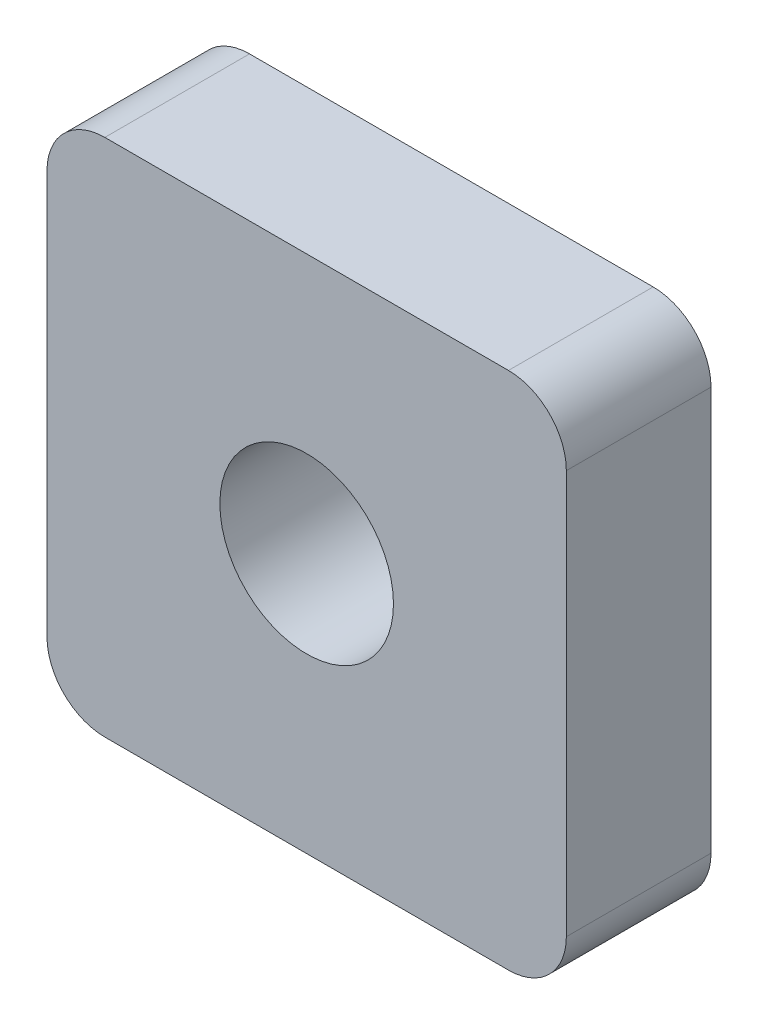
ISO-10303-21;
HEADER;
FILE_DESCRIPTION(('STEP AP214'),'2;1');
FILE_NAME('part.step','',(''),(''),'','','');
FILE_SCHEMA(('AUTOMOTIVE_DESIGN { 1 0 10303 214 1 1 1 1 }'));
ENDSEC;
DATA;
#1=APPLICATION_CONTEXT('core data for automotive mechanical design processes');
#2=APPLICATION_PROTOCOL_DEFINITION('international standard','automotive_design',2000,#1);
#3=PRODUCT_CONTEXT('',#1,'mechanical');
#4=PRODUCT('Part','Part','',(#3));
#5=PRODUCT_RELATED_PRODUCT_CATEGORY('part','',(#4));
#6=PRODUCT_DEFINITION_FORMATION('','',#4);
#7=PRODUCT_DEFINITION_CONTEXT('part definition',#1,'design');
#8=PRODUCT_DEFINITION('design','',#6,#7);
#9=PRODUCT_DEFINITION_SHAPE('','',#8);
#10=(LENGTH_UNIT() NAMED_UNIT(*) SI_UNIT(.MILLI.,.METRE.));
#11=(NAMED_UNIT(*) PLANE_ANGLE_UNIT() SI_UNIT($,.RADIAN.));
#12=(NAMED_UNIT(*) SI_UNIT($,.STERADIAN.) SOLID_ANGLE_UNIT());
#13=UNCERTAINTY_MEASURE_WITH_UNIT(LENGTH_MEASURE(1.E-05),#10,'distance_accuracy_value','');
#14=(GEOMETRIC_REPRESENTATION_CONTEXT(3) GLOBAL_UNCERTAINTY_ASSIGNED_CONTEXT((#13)) GLOBAL_UNIT_ASSIGNED_CONTEXT((#10,
#11,#12)) REPRESENTATION_CONTEXT('',''));
#15=CARTESIAN_POINT('',(0.,0.,0.));
#16=DIRECTION('',(0.,0.,1.));
#17=DIRECTION('',(1.,0.,0.));
#18=AXIS2_PLACEMENT_3D('',#15,#16,#17);
#19=CARTESIAN_POINT('',(0.,0.,5.));
#20=DIRECTION('',(0.,0.,-1.));
#21=DIRECTION('',(-1.,0.,0.));
#22=AXIS2_PLACEMENT_3D('',#19,#20,#21);
#23=PLANE('',#22);
#24=DIRECTION('',(1.,0.,0.));
#25=VECTOR('',#24,1.);
#26=CARTESIAN_POINT('',(-8.975,-8.975,5.));
#27=LINE('',#26,#25);
#28=CARTESIAN_POINT('',(-6.975,-8.975,5.));
#29=VERTEX_POINT('',#28);
#30=CARTESIAN_POINT('',(6.975,-8.975,5.));
#31=VERTEX_POINT('',#30);
#32=EDGE_CURVE('E140',#29,#31,#27,.T.);
#33=ORIENTED_EDGE('',*,*,#32,.T.);
#34=CARTESIAN_POINT('',(6.975,-6.975,5.));
#35=DIRECTION('',(0.,0.,-1.));
#36=DIRECTION('',(-1.,0.,0.));
#37=AXIS2_PLACEMENT_3D('',#34,#35,#36);
#38=CIRCLE('',#37,2.);
#39=CARTESIAN_POINT('',(8.975,-6.975,5.));
#40=VERTEX_POINT('',#39);
#41=EDGE_CURVE('E159',#31,#40,#38,.F.);
#42=ORIENTED_EDGE('',*,*,#41,.T.);
#43=DIRECTION('',(0.,1.,0.));
#44=VECTOR('',#43,1.);
#45=CARTESIAN_POINT('',(8.975,-8.975,5.));
#46=LINE('',#45,#44);
#47=CARTESIAN_POINT('',(8.975,6.975,5.));
#48=VERTEX_POINT('',#47);
#49=EDGE_CURVE('E123',#40,#48,#46,.T.);
#50=ORIENTED_EDGE('',*,*,#49,.T.);
#51=CARTESIAN_POINT('',(6.975,6.975,5.));
#52=DIRECTION('',(0.,0.,-1.));
#53=DIRECTION('',(-1.,0.,0.));
#54=AXIS2_PLACEMENT_3D('',#51,#52,#53);
#55=CIRCLE('',#54,2.);
#56=CARTESIAN_POINT('',(6.975,8.975,5.));
#57=VERTEX_POINT('',#56);
#58=EDGE_CURVE('E154',#48,#57,#55,.F.);
#59=ORIENTED_EDGE('',*,*,#58,.T.);
#60=DIRECTION('',(-1.,0.,0.));
#61=VECTOR('',#60,1.);
#62=CARTESIAN_POINT('',(-8.975,8.975,5.));
#63=LINE('',#62,#61);
#64=CARTESIAN_POINT('',(-6.975,8.975,5.));
#65=VERTEX_POINT('',#64);
#66=EDGE_CURVE('E170',#57,#65,#63,.T.);
#67=ORIENTED_EDGE('',*,*,#66,.T.);
#68=CARTESIAN_POINT('',(-6.975,6.975,5.));
#69=DIRECTION('',(0.,0.,-1.));
#70=DIRECTION('',(-1.,0.,0.));
#71=AXIS2_PLACEMENT_3D('',#68,#69,#70);
#72=CIRCLE('',#71,2.);
#73=CARTESIAN_POINT('',(-8.975,6.975,5.));
#74=VERTEX_POINT('',#73);
#75=EDGE_CURVE('E59',#65,#74,#72,.F.);
#76=ORIENTED_EDGE('',*,*,#75,.T.);
#77=DIRECTION('',(0.,-1.,0.));
#78=VECTOR('',#77,1.);
#79=CARTESIAN_POINT('',(-8.975,-8.975,5.));
#80=LINE('',#79,#78);
#81=CARTESIAN_POINT('',(-8.975,-6.975,5.));
#82=VERTEX_POINT('',#81);
#83=EDGE_CURVE('E178',#74,#82,#80,.T.);
#84=ORIENTED_EDGE('',*,*,#83,.T.);
#85=CARTESIAN_POINT('',(-6.975,-6.975,5.));
#86=DIRECTION('',(0.,0.,-1.));
#87=DIRECTION('',(-1.,0.,0.));
#88=AXIS2_PLACEMENT_3D('',#85,#86,#87);
#89=CIRCLE('',#88,2.);
#90=EDGE_CURVE('E157',#82,#29,#89,.F.);
#91=ORIENTED_EDGE('',*,*,#90,.T.);
#92=EDGE_LOOP('',(#33,#42,#50,#59,#67,#76,#84,#91));
#93=FACE_BOUND('',#92,.T.);
#94=CARTESIAN_POINT('',(0.,0.,5.));
#95=DIRECTION('',(0.,0.,1.));
#96=DIRECTION('',(1.,0.,0.));
#97=AXIS2_PLACEMENT_3D('',#94,#95,#96);
#98=CIRCLE('',#97,3.);
#99=CARTESIAN_POINT('',(3.,0.,5.));
#100=VERTEX_POINT('',#99);
#101=EDGE_CURVE('E131',#100,#100,#98,.T.);
#102=ORIENTED_EDGE('',*,*,#101,.F.);
#103=EDGE_LOOP('',(#102));
#104=FACE_BOUND('',#103,.T.);
#105=ADVANCED_FACE('F37',(#93,#104),#23,.F.);
#106=CARTESIAN_POINT('',(0.,0.,0.));
#107=DIRECTION('',(0.,0.,-1.));
#108=DIRECTION('',(-1.,0.,0.));
#109=AXIS2_PLACEMENT_3D('',#106,#107,#108);
#110=PLANE('',#109);
#111=DIRECTION('',(0.,1.,0.));
#112=VECTOR('',#111,1.);
#113=CARTESIAN_POINT('',(8.975,-8.975,0.));
#114=LINE('',#113,#112);
#115=CARTESIAN_POINT('',(8.975,-6.975,0.));
#116=VERTEX_POINT('',#115);
#117=CARTESIAN_POINT('',(8.975,6.975,0.));
#118=VERTEX_POINT('',#117);
#119=EDGE_CURVE('E120',#116,#118,#114,.T.);
#120=ORIENTED_EDGE('',*,*,#119,.F.);
#121=CARTESIAN_POINT('',(6.975,-6.975,0.));
#122=DIRECTION('',(0.,0.,-1.));
#123=DIRECTION('',(-1.,0.,0.));
#124=AXIS2_PLACEMENT_3D('',#121,#122,#123);
#125=CIRCLE('',#124,2.);
#126=CARTESIAN_POINT('',(6.975,-8.975,0.));
#127=VERTEX_POINT('',#126);
#128=EDGE_CURVE('E103',#116,#127,#125,.T.);
#129=ORIENTED_EDGE('',*,*,#128,.T.);
#130=DIRECTION('',(1.,0.,0.));
#131=VECTOR('',#130,1.);
#132=CARTESIAN_POINT('',(-8.975,-8.975,0.));
#133=LINE('',#132,#131);
#134=CARTESIAN_POINT('',(-6.975,-8.975,0.));
#135=VERTEX_POINT('',#134);
#136=EDGE_CURVE('E144',#135,#127,#133,.T.);
#137=ORIENTED_EDGE('',*,*,#136,.F.);
#138=CARTESIAN_POINT('',(-6.975,-6.975,0.));
#139=DIRECTION('',(0.,0.,-1.));
#140=DIRECTION('',(-1.,0.,0.));
#141=AXIS2_PLACEMENT_3D('',#138,#139,#140);
#142=CIRCLE('',#141,2.);
#143=CARTESIAN_POINT('',(-8.975,-6.975,0.));
#144=VERTEX_POINT('',#143);
#145=EDGE_CURVE('E114',#135,#144,#142,.T.);
#146=ORIENTED_EDGE('',*,*,#145,.T.);
#147=DIRECTION('',(0.,-1.,0.));
#148=VECTOR('',#147,1.);
#149=CARTESIAN_POINT('',(-8.975,-8.975,0.));
#150=LINE('',#149,#148);
#151=CARTESIAN_POINT('',(-8.975,6.975,0.));
#152=VERTEX_POINT('',#151);
#153=EDGE_CURVE('E134',#152,#144,#150,.T.);
#154=ORIENTED_EDGE('',*,*,#153,.F.);
#155=CARTESIAN_POINT('',(-6.975,6.975,0.));
#156=DIRECTION('',(0.,0.,-1.));
#157=DIRECTION('',(-1.,0.,0.));
#158=AXIS2_PLACEMENT_3D('',#155,#156,#157);
#159=CIRCLE('',#158,2.);
#160=CARTESIAN_POINT('',(-6.975,8.975,0.));
#161=VERTEX_POINT('',#160);
#162=EDGE_CURVE('E148',#152,#161,#159,.T.);
#163=ORIENTED_EDGE('',*,*,#162,.T.);
#164=DIRECTION('',(-1.,0.,0.));
#165=VECTOR('',#164,1.);
#166=CARTESIAN_POINT('',(-8.975,8.975,0.));
#167=LINE('',#166,#165);
#168=CARTESIAN_POINT('',(6.975,8.975,0.));
#169=VERTEX_POINT('',#168);
#170=EDGE_CURVE('E130',#169,#161,#167,.T.);
#171=ORIENTED_EDGE('',*,*,#170,.F.);
#172=CARTESIAN_POINT('',(6.975,6.975,0.));
#173=DIRECTION('',(0.,0.,-1.));
#174=DIRECTION('',(-1.,0.,0.));
#175=AXIS2_PLACEMENT_3D('',#172,#173,#174);
#176=CIRCLE('',#175,2.);
#177=EDGE_CURVE('E124',#169,#118,#176,.T.);
#178=ORIENTED_EDGE('',*,*,#177,.T.);
#179=EDGE_LOOP('',(#120,#129,#137,#146,#154,#163,#171,#178));
#180=FACE_BOUND('',#179,.T.);
#181=CARTESIAN_POINT('',(0.,0.,0.));
#182=DIRECTION('',(0.,0.,1.));
#183=DIRECTION('',(1.,0.,0.));
#184=AXIS2_PLACEMENT_3D('',#181,#182,#183);
#185=CIRCLE('',#184,3.);
#186=CARTESIAN_POINT('',(3.,0.,0.));
#187=VERTEX_POINT('',#186);
#188=EDGE_CURVE('E137',#187,#187,#185,.T.);
#189=ORIENTED_EDGE('',*,*,#188,.T.);
#190=EDGE_LOOP('',(#189));
#191=FACE_BOUND('',#190,.T.);
#192=ADVANCED_FACE('F127',(#180,#191),#110,.T.);
#193=CARTESIAN_POINT('',(8.975,-8.975,5.));
#194=DIRECTION('',(-1.,0.,0.));
#195=DIRECTION('',(0.,0.,1.));
#196=AXIS2_PLACEMENT_3D('',#193,#194,#195);
#197=PLANE('',#196);
#198=ORIENTED_EDGE('',*,*,#49,.F.);
#199=DIRECTION('',(0.,0.,-1.));
#200=VECTOR('',#199,1.);
#201=CARTESIAN_POINT('',(8.975,-6.975,5.));
#202=LINE('',#201,#200);
#203=EDGE_CURVE('E107',#40,#116,#202,.T.);
#204=ORIENTED_EDGE('',*,*,#203,.T.);
#205=ORIENTED_EDGE('',*,*,#119,.T.);
#206=DIRECTION('',(0.,0.,-1.));
#207=VECTOR('',#206,1.);
#208=CARTESIAN_POINT('',(8.975,6.975,5.));
#209=LINE('',#208,#207);
#210=EDGE_CURVE('E125',#118,#48,#209,.F.);
#211=ORIENTED_EDGE('',*,*,#210,.T.);
#212=EDGE_LOOP('',(#198,#204,#205,#211));
#213=FACE_BOUND('',#212,.T.);
#214=ADVANCED_FACE('F119',(#213),#197,.F.);
#215=CARTESIAN_POINT('',(-8.975,8.975,5.));
#216=DIRECTION('',(0.,-1.,0.));
#217=DIRECTION('',(0.,0.,-1.));
#218=AXIS2_PLACEMENT_3D('',#215,#216,#217);
#219=PLANE('',#218);
#220=ORIENTED_EDGE('',*,*,#170,.T.);
#221=DIRECTION('',(0.,0.,-1.));
#222=VECTOR('',#221,1.);
#223=CARTESIAN_POINT('',(-6.975,8.975,5.));
#224=LINE('',#223,#222);
#225=EDGE_CURVE('E11',#161,#65,#224,.F.);
#226=ORIENTED_EDGE('',*,*,#225,.T.);
#227=ORIENTED_EDGE('',*,*,#66,.F.);
#228=DIRECTION('',(0.,0.,-1.));
#229=VECTOR('',#228,1.);
#230=CARTESIAN_POINT('',(6.975,8.975,5.));
#231=LINE('',#230,#229);
#232=EDGE_CURVE('E45',#57,#169,#231,.T.);
#233=ORIENTED_EDGE('',*,*,#232,.T.);
#234=EDGE_LOOP('',(#220,#226,#227,#233));
#235=FACE_BOUND('',#234,.T.);
#236=ADVANCED_FACE('F168',(#235),#219,.F.);
#237=CARTESIAN_POINT('',(-8.975,-8.975,5.));
#238=DIRECTION('',(1.,0.,0.));
#239=DIRECTION('',(0.,0.,-1.));
#240=AXIS2_PLACEMENT_3D('',#237,#238,#239);
#241=PLANE('',#240);
#242=ORIENTED_EDGE('',*,*,#153,.T.);
#243=DIRECTION('',(0.,0.,-1.));
#244=VECTOR('',#243,1.);
#245=CARTESIAN_POINT('',(-8.975,-6.975,5.));
#246=LINE('',#245,#244);
#247=EDGE_CURVE('E52',#144,#82,#246,.F.);
#248=ORIENTED_EDGE('',*,*,#247,.T.);
#249=ORIENTED_EDGE('',*,*,#83,.F.);
#250=DIRECTION('',(0.,0.,-1.));
#251=VECTOR('',#250,1.);
#252=CARTESIAN_POINT('',(-8.975,6.975,5.));
#253=LINE('',#252,#251);
#254=EDGE_CURVE('E161',#74,#152,#253,.T.);
#255=ORIENTED_EDGE('',*,*,#254,.T.);
#256=EDGE_LOOP('',(#242,#248,#249,#255));
#257=FACE_BOUND('',#256,.T.);
#258=ADVANCED_FACE('F177',(#257),#241,.F.);
#259=CARTESIAN_POINT('',(-8.975,-8.975,5.));
#260=DIRECTION('',(0.,1.,0.));
#261=DIRECTION('',(0.,0.,1.));
#262=AXIS2_PLACEMENT_3D('',#259,#260,#261);
#263=PLANE('',#262);
#264=ORIENTED_EDGE('',*,*,#136,.T.);
#265=DIRECTION('',(0.,0.,-1.));
#266=VECTOR('',#265,1.);
#267=CARTESIAN_POINT('',(6.975,-8.975,5.));
#268=LINE('',#267,#266);
#269=EDGE_CURVE('E108',#127,#31,#268,.F.);
#270=ORIENTED_EDGE('',*,*,#269,.T.);
#271=ORIENTED_EDGE('',*,*,#32,.F.);
#272=DIRECTION('',(0.,0.,-1.));
#273=VECTOR('',#272,1.);
#274=CARTESIAN_POINT('',(-6.975,-8.975,5.));
#275=LINE('',#274,#273);
#276=EDGE_CURVE('E113',#29,#135,#275,.T.);
#277=ORIENTED_EDGE('',*,*,#276,.T.);
#278=EDGE_LOOP('',(#264,#270,#271,#277));
#279=FACE_BOUND('',#278,.T.);
#280=ADVANCED_FACE('F189',(#279),#263,.F.);
#281=CARTESIAN_POINT('',(0.,0.,5.));
#282=DIRECTION('',(0.,0.,-1.));
#283=DIRECTION('',(-1.,0.,0.));
#284=AXIS2_PLACEMENT_3D('',#281,#282,#283);
#285=CYLINDRICAL_SURFACE('',#284,3.);
#286=ORIENTED_EDGE('',*,*,#101,.T.);
#287=EDGE_LOOP('',(#286));
#288=FACE_BOUND('',#287,.T.);
#289=ORIENTED_EDGE('',*,*,#188,.F.);
#290=EDGE_LOOP('',(#289));
#291=FACE_BOUND('',#290,.T.);
#292=ADVANCED_FACE('F187',(#288,#291),#285,.F.);
#293=CARTESIAN_POINT('',(6.975,-6.975,5.));
#294=DIRECTION('',(0.,0.,-1.));
#295=DIRECTION('',(-1.,0.,0.));
#296=AXIS2_PLACEMENT_3D('',#293,#294,#295);
#297=CYLINDRICAL_SURFACE('',#296,2.);
#298=ORIENTED_EDGE('',*,*,#41,.F.);
#299=ORIENTED_EDGE('',*,*,#269,.F.);
#300=ORIENTED_EDGE('',*,*,#128,.F.);
#301=ORIENTED_EDGE('',*,*,#203,.F.);
#302=EDGE_LOOP('',(#298,#299,#300,#301));
#303=FACE_BOUND('',#302,.T.);
#304=ADVANCED_FACE('F106',(#303),#297,.T.);
#305=CARTESIAN_POINT('',(-6.975,-6.975,5.));
#306=DIRECTION('',(0.,0.,-1.));
#307=DIRECTION('',(-1.,0.,0.));
#308=AXIS2_PLACEMENT_3D('',#305,#306,#307);
#309=CYLINDRICAL_SURFACE('',#308,2.);
#310=ORIENTED_EDGE('',*,*,#90,.F.);
#311=ORIENTED_EDGE('',*,*,#247,.F.);
#312=ORIENTED_EDGE('',*,*,#145,.F.);
#313=ORIENTED_EDGE('',*,*,#276,.F.);
#314=EDGE_LOOP('',(#310,#311,#312,#313));
#315=FACE_BOUND('',#314,.T.);
#316=ADVANCED_FACE('F196',(#315),#309,.T.);
#317=CARTESIAN_POINT('',(-6.975,6.975,5.));
#318=DIRECTION('',(0.,0.,-1.));
#319=DIRECTION('',(-1.,0.,0.));
#320=AXIS2_PLACEMENT_3D('',#317,#318,#319);
#321=CYLINDRICAL_SURFACE('',#320,2.);
#322=ORIENTED_EDGE('',*,*,#75,.F.);
#323=ORIENTED_EDGE('',*,*,#225,.F.);
#324=ORIENTED_EDGE('',*,*,#162,.F.);
#325=ORIENTED_EDGE('',*,*,#254,.F.);
#326=EDGE_LOOP('',(#322,#323,#324,#325));
#327=FACE_BOUND('',#326,.T.);
#328=ADVANCED_FACE('F176',(#327),#321,.T.);
#329=CARTESIAN_POINT('',(6.975,6.975,5.));
#330=DIRECTION('',(0.,0.,-1.));
#331=DIRECTION('',(-1.,0.,0.));
#332=AXIS2_PLACEMENT_3D('',#329,#330,#331);
#333=CYLINDRICAL_SURFACE('',#332,2.);
#334=ORIENTED_EDGE('',*,*,#58,.F.);
#335=ORIENTED_EDGE('',*,*,#210,.F.);
#336=ORIENTED_EDGE('',*,*,#177,.F.);
#337=ORIENTED_EDGE('',*,*,#232,.F.);
#338=EDGE_LOOP('',(#334,#335,#336,#337));
#339=FACE_BOUND('',#338,.T.);
#340=ADVANCED_FACE('F39',(#339),#333,.T.);
#341=CLOSED_SHELL('',(#105,#192,#214,#236,#258,#280,#292,#304,#316,#328,#340));
#342=MANIFOLD_SOLID_BREP('B2',#341);
#343=ADVANCED_BREP_SHAPE_REPRESENTATION('',(#18,#342),#14);
#344=SHAPE_DEFINITION_REPRESENTATION(#9,#343);
ENDSEC;
END-ISO-10303-21;
